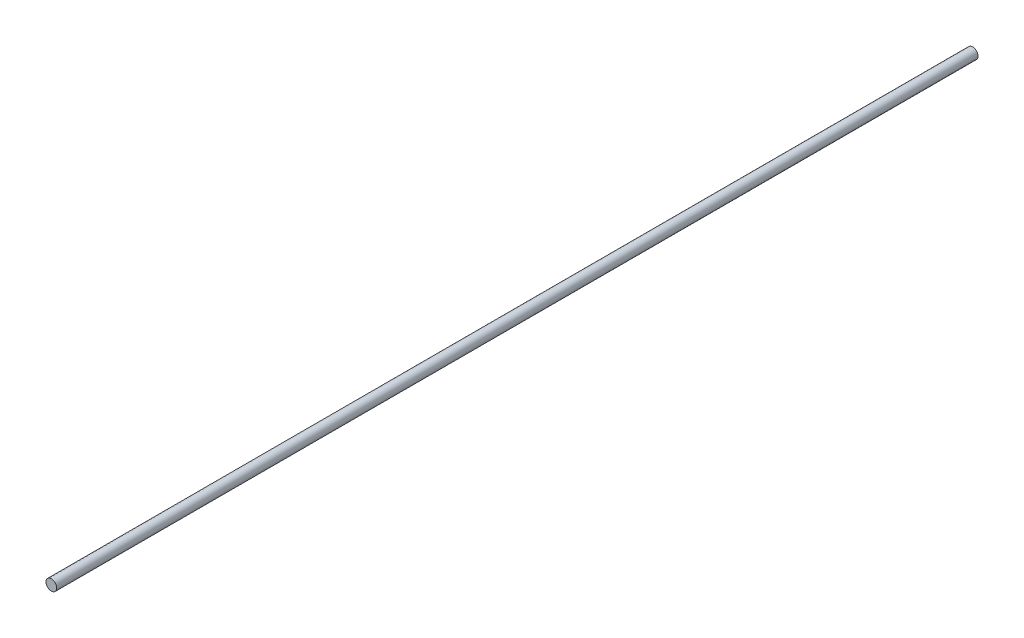
ISO-10303-21;
HEADER;
FILE_DESCRIPTION(('STEP AP214'),'2;1');
FILE_NAME('part.step','',(''),(''),'','','');
FILE_SCHEMA(('AUTOMOTIVE_DESIGN { 1 0 10303 214 1 1 1 1 }'));
ENDSEC;
DATA;
#1=APPLICATION_CONTEXT('core data for automotive mechanical design processes');
#2=APPLICATION_PROTOCOL_DEFINITION('international standard','automotive_design',2000,#1);
#3=PRODUCT_CONTEXT('',#1,'mechanical');
#4=PRODUCT('Part','Part','',(#3));
#5=PRODUCT_RELATED_PRODUCT_CATEGORY('part','',(#4));
#6=PRODUCT_DEFINITION_FORMATION('','',#4);
#7=PRODUCT_DEFINITION_CONTEXT('part definition',#1,'design');
#8=PRODUCT_DEFINITION('design','',#6,#7);
#9=PRODUCT_DEFINITION_SHAPE('','',#8);
#10=(LENGTH_UNIT() NAMED_UNIT(*) SI_UNIT(.MILLI.,.METRE.));
#11=(NAMED_UNIT(*) PLANE_ANGLE_UNIT() SI_UNIT($,.RADIAN.));
#12=(NAMED_UNIT(*) SI_UNIT($,.STERADIAN.) SOLID_ANGLE_UNIT());
#13=UNCERTAINTY_MEASURE_WITH_UNIT(LENGTH_MEASURE(1.E-05),#10,'distance_accuracy_value','');
#14=(GEOMETRIC_REPRESENTATION_CONTEXT(3) GLOBAL_UNCERTAINTY_ASSIGNED_CONTEXT((#13)) GLOBAL_UNIT_ASSIGNED_CONTEXT((#10,
#11,#12)) REPRESENTATION_CONTEXT('',''));
#15=CARTESIAN_POINT('',(0.,0.,0.));
#16=DIRECTION('',(0.,0.,1.));
#17=DIRECTION('',(1.,0.,0.));
#18=AXIS2_PLACEMENT_3D('',#15,#16,#17);
#19=CARTESIAN_POINT('',(0.,0.,688.));
#20=DIRECTION('',(0.,0.,-1.));
#21=DIRECTION('',(-1.,0.,0.));
#22=AXIS2_PLACEMENT_3D('',#19,#20,#21);
#23=CYLINDRICAL_SURFACE('',#22,4.);
#24=CARTESIAN_POINT('',(0.,0.,688.));
#25=DIRECTION('',(0.,0.,1.));
#26=DIRECTION('',(1.,0.,0.));
#27=AXIS2_PLACEMENT_3D('',#24,#25,#26);
#28=CIRCLE('',#27,4.);
#29=CARTESIAN_POINT('',(4.,0.,688.));
#30=VERTEX_POINT('',#29);
#31=EDGE_CURVE('E10',#30,#30,#28,.T.);
#32=ORIENTED_EDGE('',*,*,#31,.F.);
#33=EDGE_LOOP('',(#32));
#34=FACE_BOUND('',#33,.T.);
#35=CARTESIAN_POINT('',(0.,0.,0.));
#36=DIRECTION('',(0.,0.,1.));
#37=DIRECTION('',(1.,0.,0.));
#38=AXIS2_PLACEMENT_3D('',#35,#36,#37);
#39=CIRCLE('',#38,4.);
#40=CARTESIAN_POINT('',(4.,0.,0.));
#41=VERTEX_POINT('',#40);
#42=EDGE_CURVE('E34',#41,#41,#39,.T.);
#43=ORIENTED_EDGE('',*,*,#42,.T.);
#44=EDGE_LOOP('',(#43));
#45=FACE_BOUND('',#44,.T.);
#46=ADVANCED_FACE('F31',(#34,#45),#23,.T.);
#47=CARTESIAN_POINT('',(0.,0.,688.));
#48=DIRECTION('',(0.,0.,1.));
#49=DIRECTION('',(1.,0.,0.));
#50=AXIS2_PLACEMENT_3D('',#47,#48,#49);
#51=PLANE('',#50);
#52=ORIENTED_EDGE('',*,*,#31,.T.);
#53=EDGE_LOOP('',(#52));
#54=FACE_BOUND('',#53,.T.);
#55=ADVANCED_FACE('F46',(#54),#51,.T.);
#56=CARTESIAN_POINT('',(0.,0.,0.));
#57=DIRECTION('',(0.,0.,1.));
#58=DIRECTION('',(1.,0.,0.));
#59=AXIS2_PLACEMENT_3D('',#56,#57,#58);
#60=PLANE('',#59);
#61=ORIENTED_EDGE('',*,*,#42,.F.);
#62=EDGE_LOOP('',(#61));
#63=FACE_BOUND('',#62,.T.);
#64=ADVANCED_FACE('F44',(#63),#60,.F.);
#65=CLOSED_SHELL('',(#46,#55,#64));
#66=MANIFOLD_SOLID_BREP('B2',#65);
#67=ADVANCED_BREP_SHAPE_REPRESENTATION('',(#18,#66),#14);
#68=SHAPE_DEFINITION_REPRESENTATION(#9,#67);
ENDSEC;
END-ISO-10303-21;
